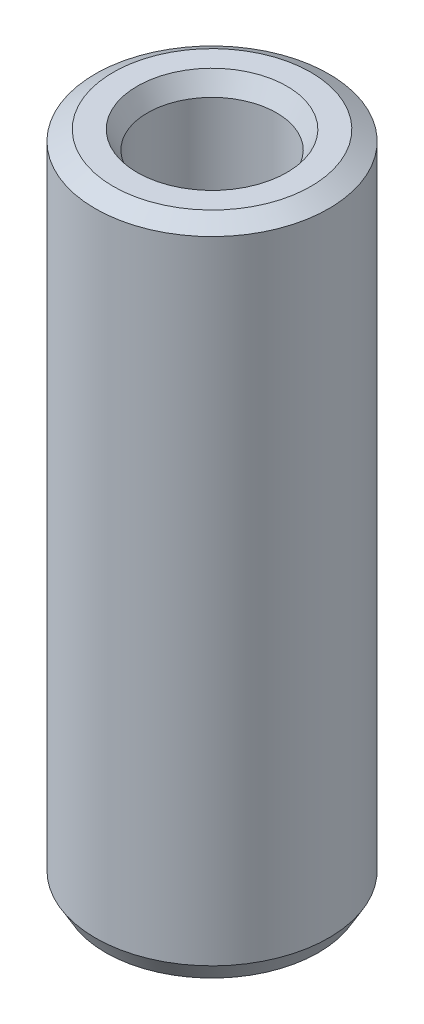
ISO-10303-21;
HEADER;
FILE_DESCRIPTION(('STEP AP214'),'2;1');
FILE_NAME('part.step','',(''),(''),'','','');
FILE_SCHEMA(('AUTOMOTIVE_DESIGN { 1 0 10303 214 1 1 1 1 }'));
ENDSEC;
DATA;
#1=APPLICATION_CONTEXT('core data for automotive mechanical design processes');
#2=APPLICATION_PROTOCOL_DEFINITION('international standard','automotive_design',2000,#1);
#3=PRODUCT_CONTEXT('',#1,'mechanical');
#4=PRODUCT('Part','Part','',(#3));
#5=PRODUCT_RELATED_PRODUCT_CATEGORY('part','',(#4));
#6=PRODUCT_DEFINITION_FORMATION('','',#4);
#7=PRODUCT_DEFINITION_CONTEXT('part definition',#1,'design');
#8=PRODUCT_DEFINITION('design','',#6,#7);
#9=PRODUCT_DEFINITION_SHAPE('','',#8);
#10=(LENGTH_UNIT() NAMED_UNIT(*) SI_UNIT(.MILLI.,.METRE.));
#11=(NAMED_UNIT(*) PLANE_ANGLE_UNIT() SI_UNIT($,.RADIAN.));
#12=(NAMED_UNIT(*) SI_UNIT($,.STERADIAN.) SOLID_ANGLE_UNIT());
#13=UNCERTAINTY_MEASURE_WITH_UNIT(LENGTH_MEASURE(1.E-05),#10,'distance_accuracy_value','');
#14=(GEOMETRIC_REPRESENTATION_CONTEXT(3) GLOBAL_UNCERTAINTY_ASSIGNED_CONTEXT((#13)) GLOBAL_UNIT_ASSIGNED_CONTEXT((#10,
#11,#12)) REPRESENTATION_CONTEXT('',''));
#15=CARTESIAN_POINT('',(0.,0.,0.));
#16=DIRECTION('',(0.,0.,1.));
#17=DIRECTION('',(1.,0.,0.));
#18=AXIS2_PLACEMENT_3D('',#15,#16,#17);
#19=CARTESIAN_POINT('',(0.,28.2539856806415,0.));
#20=DIRECTION('',(0.,-1.,0.));
#21=DIRECTION('',(0.,0.,-1.));
#22=AXIS2_PLACEMENT_3D('',#19,#20,#21);
#23=CYLINDRICAL_SURFACE('',#22,5.);
#24=CARTESIAN_POINT('',(0.,0.766878034424011,0.));
#25=DIRECTION('',(0.,1.,0.));
#26=DIRECTION('',(0.,0.,1.));
#27=AXIS2_PLACEMENT_3D('',#24,#25,#26);
#28=CIRCLE('',#27,5.);
#29=CARTESIAN_POINT('',(0.,0.766878034424011,5.));
#30=VERTEX_POINT('',#29);
#31=EDGE_CURVE('E10',#30,#30,#28,.T.);
#32=ORIENTED_EDGE('',*,*,#31,.T.);
#33=EDGE_LOOP('',(#32));
#34=FACE_BOUND('',#33,.T.);
#35=CARTESIAN_POINT('',(0.,27.8112284410312,0.));
#36=DIRECTION('',(0.,1.,0.));
#37=DIRECTION('',(0.,0.,1.));
#38=AXIS2_PLACEMENT_3D('',#35,#36,#37);
#39=CIRCLE('',#38,5.);
#40=CARTESIAN_POINT('',(0.,27.8112284410312,5.));
#41=VERTEX_POINT('',#40);
#42=EDGE_CURVE('E50',#41,#41,#39,.F.);
#43=ORIENTED_EDGE('',*,*,#42,.T.);
#44=EDGE_LOOP('',(#43));
#45=FACE_BOUND('',#44,.T.);
#46=ADVANCED_FACE('F39',(#34,#45),#23,.T.);
#47=CARTESIAN_POINT('',(0.,28.2539856806415,0.));
#48=DIRECTION('',(0.,1.,0.));
#49=DIRECTION('',(0.,0.,1.));
#50=AXIS2_PLACEMENT_3D('',#47,#48,#49);
#51=PLANE('',#50);
#52=CARTESIAN_POINT('',(0.,28.2539856806415,0.));
#53=DIRECTION('',(0.,1.,0.));
#54=DIRECTION('',(0.,0.,1.));
#55=AXIS2_PLACEMENT_3D('',#52,#53,#54);
#56=CIRCLE('',#55,3.20495597689249);
#57=CARTESIAN_POINT('',(0.,28.2539856806415,3.20495597689249));
#58=VERTEX_POINT('',#57);
#59=EDGE_CURVE('E58',#58,#58,#56,.F.);
#60=ORIENTED_EDGE('',*,*,#59,.T.);
#61=EDGE_LOOP('',(#60));
#62=FACE_BOUND('',#61,.T.);
#63=CARTESIAN_POINT('',(0.,28.2539856806415,0.));
#64=DIRECTION('',(0.,1.,0.));
#65=DIRECTION('',(0.,0.,1.));
#66=AXIS2_PLACEMENT_3D('',#63,#64,#65);
#67=CIRCLE('',#66,4.23312196557598);
#68=CARTESIAN_POINT('',(0.,28.2539856806415,4.23312196557598));
#69=VERTEX_POINT('',#68);
#70=EDGE_CURVE('E61',#69,#69,#67,.T.);
#71=ORIENTED_EDGE('',*,*,#70,.T.);
#72=EDGE_LOOP('',(#71));
#73=FACE_BOUND('',#72,.T.);
#74=ADVANCED_FACE('F88',(#62,#73),#51,.T.);
#75=CARTESIAN_POINT('',(0.,0.,0.));
#76=DIRECTION('',(0.,1.,0.));
#77=DIRECTION('',(0.,0.,1.));
#78=AXIS2_PLACEMENT_3D('',#75,#76,#77);
#79=PLANE('',#78);
#80=CARTESIAN_POINT('',(0.,0.,0.));
#81=DIRECTION('',(0.,1.,0.));
#82=DIRECTION('',(0.,0.,1.));
#83=AXIS2_PLACEMENT_3D('',#80,#81,#82);
#84=CIRCLE('',#83,3.52907677170618);
#85=CARTESIAN_POINT('',(0.,0.,3.52907677170618));
#86=VERTEX_POINT('',#85);
#87=EDGE_CURVE('E51',#86,#86,#84,.T.);
#88=ORIENTED_EDGE('',*,*,#87,.T.);
#89=EDGE_LOOP('',(#88));
#90=FACE_BOUND('',#89,.T.);
#91=CARTESIAN_POINT('',(0.,0.,0.));
#92=DIRECTION('',(0.,1.,0.));
#93=DIRECTION('',(0.,0.,1.));
#94=AXIS2_PLACEMENT_3D('',#91,#92,#93);
#95=CIRCLE('',#94,4.55724276038968);
#96=CARTESIAN_POINT('',(0.,0.,4.55724276038968));
#97=VERTEX_POINT('',#96);
#98=EDGE_CURVE('E54',#97,#97,#95,.F.);
#99=ORIENTED_EDGE('',*,*,#98,.T.);
#100=EDGE_LOOP('',(#99));
#101=FACE_BOUND('',#100,.T.);
#102=ADVANCED_FACE('F83',(#90,#101),#79,.F.);
#103=CARTESIAN_POINT('',(0.,28.2539856806415,0.));
#104=DIRECTION('',(0.,-1.,0.));
#105=DIRECTION('',(0.,0.,-1.));
#106=AXIS2_PLACEMENT_3D('',#103,#104,#105);
#107=CYLINDRICAL_SURFACE('',#106,2.76219873728217);
#108=CARTESIAN_POINT('',(0.,27.4871076462175,0.));
#109=DIRECTION('',(0.,1.,0.));
#110=DIRECTION('',(0.,0.,1.));
#111=AXIS2_PLACEMENT_3D('',#108,#109,#110);
#112=CIRCLE('',#111,2.76219873728217);
#113=CARTESIAN_POINT('',(0.,27.4871076462175,2.76219873728217));
#114=VERTEX_POINT('',#113);
#115=EDGE_CURVE('E67',#114,#114,#112,.T.);
#116=ORIENTED_EDGE('',*,*,#115,.T.);
#117=EDGE_LOOP('',(#116));
#118=FACE_BOUND('',#117,.T.);
#119=CARTESIAN_POINT('',(0.,0.44275723961032,0.));
#120=DIRECTION('',(0.,1.,0.));
#121=DIRECTION('',(0.,0.,1.));
#122=AXIS2_PLACEMENT_3D('',#119,#120,#121);
#123=CIRCLE('',#122,2.76219873728217);
#124=CARTESIAN_POINT('',(0.,0.44275723961032,2.76219873728217));
#125=VERTEX_POINT('',#124);
#126=EDGE_CURVE('E69',#125,#125,#123,.F.);
#127=ORIENTED_EDGE('',*,*,#126,.T.);
#128=EDGE_LOOP('',(#127));
#129=FACE_BOUND('',#128,.T.);
#130=ADVANCED_FACE('F71',(#118,#129),#107,.F.);
#131=CARTESIAN_POINT('',(0.,27.4871076462175,0.));
#132=DIRECTION('',(0.,1.,0.));
#133=DIRECTION('',(0.,0.,1.));
#134=AXIS2_PLACEMENT_3D('',#131,#132,#133);
#135=CONICAL_SURFACE('',#134,2.76219873728217,0.523598775598297);
#136=ORIENTED_EDGE('',*,*,#59,.F.);
#137=EDGE_LOOP('',(#136));
#138=FACE_BOUND('',#137,.T.);
#139=ORIENTED_EDGE('',*,*,#115,.F.);
#140=EDGE_LOOP('',(#139));
#141=FACE_BOUND('',#140,.T.);
#142=ADVANCED_FACE('F77',(#138,#141),#135,.F.);
#143=CARTESIAN_POINT('',(0.,0.,0.));
#144=DIRECTION('',(0.,-1.,0.));
#145=DIRECTION('',(0.,0.,-1.));
#146=AXIS2_PLACEMENT_3D('',#143,#144,#145);
#147=CONICAL_SURFACE('',#146,3.52907677170618,1.04719755119659);
#148=ORIENTED_EDGE('',*,*,#126,.F.);
#149=EDGE_LOOP('',(#148));
#150=FACE_BOUND('',#149,.T.);
#151=ORIENTED_EDGE('',*,*,#87,.F.);
#152=EDGE_LOOP('',(#151));
#153=FACE_BOUND('',#152,.T.);
#154=ADVANCED_FACE('F73',(#150,#153),#147,.F.);
#155=CARTESIAN_POINT('',(0.,0.766878034424011,0.));
#156=DIRECTION('',(0.,1.,0.));
#157=DIRECTION('',(0.,0.,1.));
#158=AXIS2_PLACEMENT_3D('',#155,#156,#157);
#159=CONICAL_SURFACE('',#158,5.,0.523598775598305);
#160=ORIENTED_EDGE('',*,*,#98,.F.);
#161=EDGE_LOOP('',(#160));
#162=FACE_BOUND('',#161,.T.);
#163=ORIENTED_EDGE('',*,*,#31,.F.);
#164=EDGE_LOOP('',(#163));
#165=FACE_BOUND('',#164,.T.);
#166=ADVANCED_FACE('F76',(#162,#165),#159,.T.);
#167=CARTESIAN_POINT('',(0.,28.2539856806415,0.));
#168=DIRECTION('',(0.,-1.,0.));
#169=DIRECTION('',(0.,0.,-1.));
#170=AXIS2_PLACEMENT_3D('',#167,#168,#169);
#171=CONICAL_SURFACE('',#170,4.23312196557598,1.04719755119659);
#172=ORIENTED_EDGE('',*,*,#42,.F.);
#173=EDGE_LOOP('',(#172));
#174=FACE_BOUND('',#173,.T.);
#175=ORIENTED_EDGE('',*,*,#70,.F.);
#176=EDGE_LOOP('',(#175));
#177=FACE_BOUND('',#176,.T.);
#178=ADVANCED_FACE('F45',(#174,#177),#171,.T.);
#179=CLOSED_SHELL('',(#46,#74,#102,#130,#142,#154,#166,#178));
#180=MANIFOLD_SOLID_BREP('B2',#179);
#181=ADVANCED_BREP_SHAPE_REPRESENTATION('',(#18,#180),#14);
#182=SHAPE_DEFINITION_REPRESENTATION(#9,#181);
ENDSEC;
END-ISO-10303-21;
